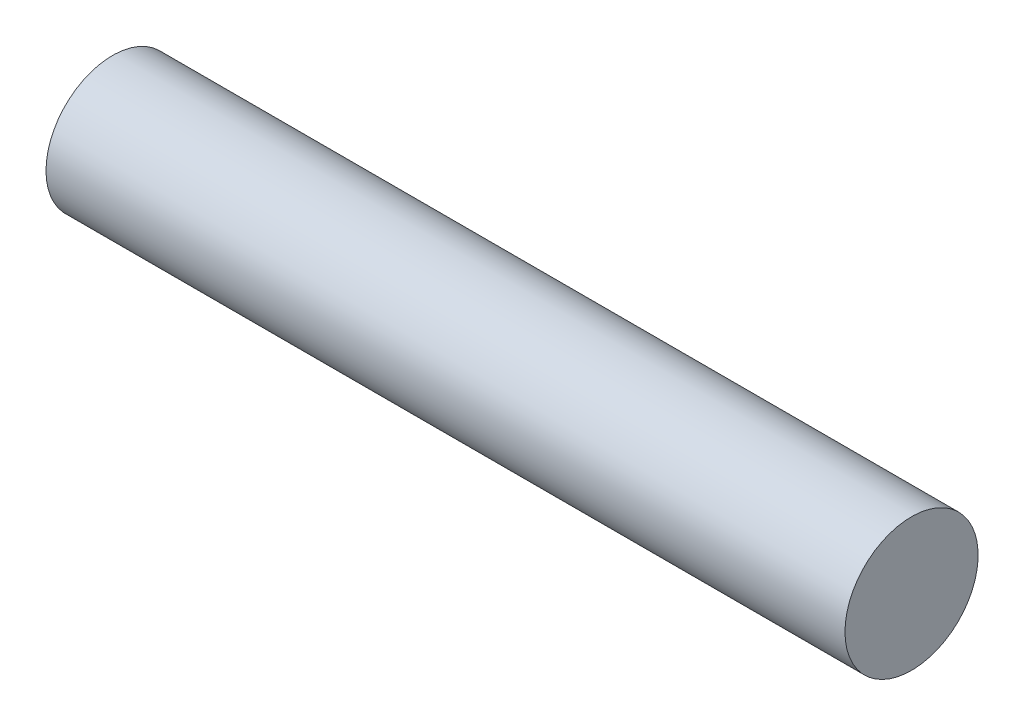
ISO-10303-21;
HEADER;
FILE_DESCRIPTION(('STEP AP214'),'2;1');
FILE_NAME('part.step','',(''),(''),'','','');
FILE_SCHEMA(('AUTOMOTIVE_DESIGN { 1 0 10303 214 1 1 1 1 }'));
ENDSEC;
DATA;
#1=APPLICATION_CONTEXT('core data for automotive mechanical design processes');
#2=APPLICATION_PROTOCOL_DEFINITION('international standard','automotive_design',2000,#1);
#3=PRODUCT_CONTEXT('',#1,'mechanical');
#4=PRODUCT('Part','Part','',(#3));
#5=PRODUCT_RELATED_PRODUCT_CATEGORY('part','',(#4));
#6=PRODUCT_DEFINITION_FORMATION('','',#4);
#7=PRODUCT_DEFINITION_CONTEXT('part definition',#1,'design');
#8=PRODUCT_DEFINITION('design','',#6,#7);
#9=PRODUCT_DEFINITION_SHAPE('','',#8);
#10=(LENGTH_UNIT() NAMED_UNIT(*) SI_UNIT(.MILLI.,.METRE.));
#11=(NAMED_UNIT(*) PLANE_ANGLE_UNIT() SI_UNIT($,.RADIAN.));
#12=(NAMED_UNIT(*) SI_UNIT($,.STERADIAN.) SOLID_ANGLE_UNIT());
#13=UNCERTAINTY_MEASURE_WITH_UNIT(LENGTH_MEASURE(1.E-05),#10,'distance_accuracy_value','');
#14=(GEOMETRIC_REPRESENTATION_CONTEXT(3) GLOBAL_UNCERTAINTY_ASSIGNED_CONTEXT((#13)) GLOBAL_UNIT_ASSIGNED_CONTEXT((#10,
#11,#12)) REPRESENTATION_CONTEXT('',''));
#15=CARTESIAN_POINT('',(0.,0.,0.));
#16=DIRECTION('',(0.,0.,1.));
#17=DIRECTION('',(1.,0.,0.));
#18=AXIS2_PLACEMENT_3D('',#15,#16,#17);
#19=CARTESIAN_POINT('',(600.,0.,0.));
#20=DIRECTION('',(-1.,0.,0.));
#21=DIRECTION('',(0.,0.,1.));
#22=AXIS2_PLACEMENT_3D('',#19,#20,#21);
#23=PLANE('',#22);
#24=CARTESIAN_POINT('',(600.,0.,0.));
#25=DIRECTION('',(-1.,0.,0.));
#26=DIRECTION('',(0.,0.,1.));
#27=AXIS2_PLACEMENT_3D('',#24,#25,#26);
#28=CIRCLE('',#27,50.);
#29=CARTESIAN_POINT('',(600.,0.,50.));
#30=VERTEX_POINT('',#29);
#31=EDGE_CURVE('E47',#30,#30,#28,.T.);
#32=ORIENTED_EDGE('',*,*,#31,.F.);
#33=EDGE_LOOP('',(#32));
#34=FACE_BOUND('',#33,.T.);
#35=ADVANCED_FACE('F33',(#34),#23,.F.);
#36=CARTESIAN_POINT('',(594.,44.,0.));
#37=DIRECTION('',(1.,0.,0.));
#38=DIRECTION('',(0.,0.,-1.));
#39=AXIS2_PLACEMENT_3D('',#36,#37,#38);
#40=PLANE('',#39);
#41=CARTESIAN_POINT('',(594.,0.,0.));
#42=DIRECTION('',(-1.,0.,0.));
#43=DIRECTION('',(0.,0.,1.));
#44=AXIS2_PLACEMENT_3D('',#41,#42,#43);
#45=CIRCLE('',#44,44.);
#46=CARTESIAN_POINT('',(594.,0.,44.));
#47=VERTEX_POINT('',#46);
#48=EDGE_CURVE('E10',#47,#47,#45,.T.);
#49=ORIENTED_EDGE('',*,*,#48,.T.);
#50=EDGE_LOOP('',(#49));
#51=FACE_BOUND('',#50,.T.);
#52=ADVANCED_FACE('F56',(#51),#40,.F.);
#53=CARTESIAN_POINT('',(0.,0.,0.));
#54=DIRECTION('',(-1.,0.,0.));
#55=DIRECTION('',(0.,0.,1.));
#56=AXIS2_PLACEMENT_3D('',#53,#54,#55);
#57=CYLINDRICAL_SURFACE('',#56,44.);
#58=ORIENTED_EDGE('',*,*,#48,.F.);
#59=EDGE_LOOP('',(#58));
#60=FACE_BOUND('',#59,.T.);
#61=CARTESIAN_POINT('',(0.,0.,0.));
#62=DIRECTION('',(-1.,0.,0.));
#63=DIRECTION('',(0.,0.,1.));
#64=AXIS2_PLACEMENT_3D('',#61,#62,#63);
#65=CIRCLE('',#64,44.);
#66=CARTESIAN_POINT('',(0.,0.,44.));
#67=VERTEX_POINT('',#66);
#68=EDGE_CURVE('E39',#67,#67,#65,.T.);
#69=ORIENTED_EDGE('',*,*,#68,.T.);
#70=EDGE_LOOP('',(#69));
#71=FACE_BOUND('',#70,.T.);
#72=ADVANCED_FACE('F60',(#60,#71),#57,.F.);
#73=CARTESIAN_POINT('',(0.,44.,0.));
#74=DIRECTION('',(1.,0.,0.));
#75=DIRECTION('',(0.,0.,-1.));
#76=AXIS2_PLACEMENT_3D('',#73,#74,#75);
#77=PLANE('',#76);
#78=ORIENTED_EDGE('',*,*,#68,.F.);
#79=EDGE_LOOP('',(#78));
#80=FACE_BOUND('',#79,.T.);
#81=CARTESIAN_POINT('',(0.,0.,0.));
#82=DIRECTION('',(-1.,0.,0.));
#83=DIRECTION('',(0.,0.,1.));
#84=AXIS2_PLACEMENT_3D('',#81,#82,#83);
#85=CIRCLE('',#84,50.);
#86=CARTESIAN_POINT('',(0.,0.,50.));
#87=VERTEX_POINT('',#86);
#88=EDGE_CURVE('E43',#87,#87,#85,.T.);
#89=ORIENTED_EDGE('',*,*,#88,.T.);
#90=EDGE_LOOP('',(#89));
#91=FACE_BOUND('',#90,.T.);
#92=ADVANCED_FACE('F64',(#80,#91),#77,.F.);
#93=CARTESIAN_POINT('',(0.,0.,0.));
#94=DIRECTION('',(-1.,0.,0.));
#95=DIRECTION('',(0.,0.,1.));
#96=AXIS2_PLACEMENT_3D('',#93,#94,#95);
#97=CYLINDRICAL_SURFACE('',#96,50.);
#98=ORIENTED_EDGE('',*,*,#88,.F.);
#99=EDGE_LOOP('',(#98));
#100=FACE_BOUND('',#99,.T.);
#101=ORIENTED_EDGE('',*,*,#31,.T.);
#102=EDGE_LOOP('',(#101));
#103=FACE_BOUND('',#102,.T.);
#104=ADVANCED_FACE('F53',(#100,#103),#97,.T.);
#105=CLOSED_SHELL('',(#35,#52,#72,#92,#104));
#106=MANIFOLD_SOLID_BREP('B2',#105);
#107=ADVANCED_BREP_SHAPE_REPRESENTATION('',(#18,#106),#14);
#108=SHAPE_DEFINITION_REPRESENTATION(#9,#107);
ENDSEC;
END-ISO-10303-21;
